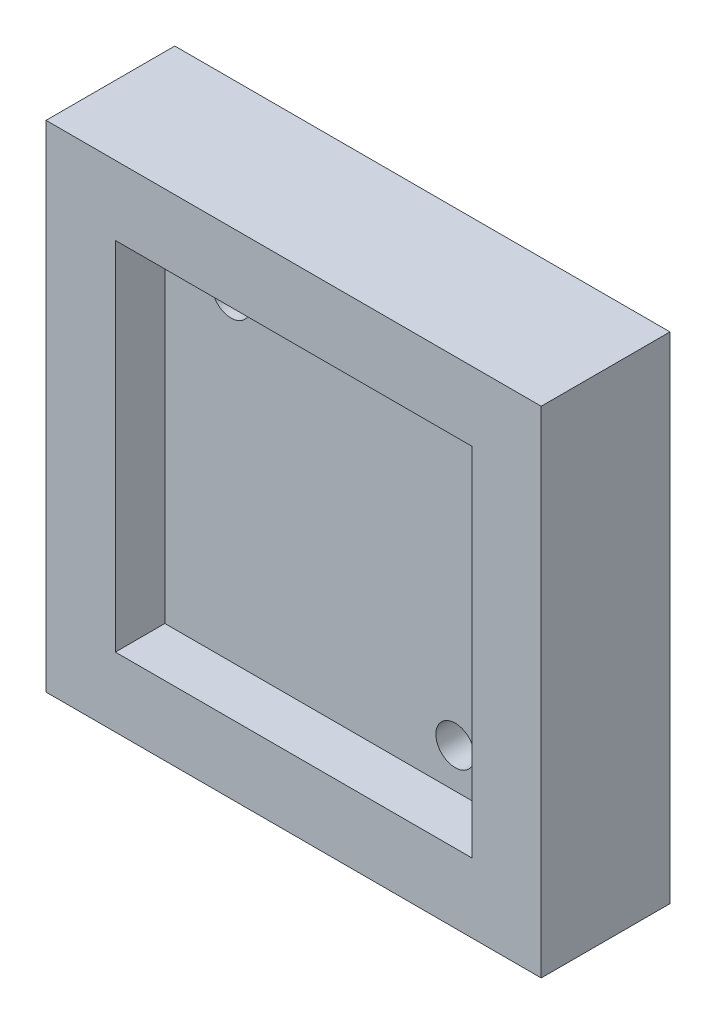
ISO-10303-21;
HEADER;
FILE_DESCRIPTION(('STEP AP214'),'2;1');
FILE_NAME('part.step','',(''),(''),'','','');
FILE_SCHEMA(('AUTOMOTIVE_DESIGN { 1 0 10303 214 1 1 1 1 }'));
ENDSEC;
DATA;
#1=APPLICATION_CONTEXT('core data for automotive mechanical design processes');
#2=APPLICATION_PROTOCOL_DEFINITION('international standard','automotive_design',2000,#1);
#3=PRODUCT_CONTEXT('',#1,'mechanical');
#4=PRODUCT('Part','Part','',(#3));
#5=PRODUCT_RELATED_PRODUCT_CATEGORY('part','',(#4));
#6=PRODUCT_DEFINITION_FORMATION('','',#4);
#7=PRODUCT_DEFINITION_CONTEXT('part definition',#1,'design');
#8=PRODUCT_DEFINITION('design','',#6,#7);
#9=PRODUCT_DEFINITION_SHAPE('','',#8);
#10=(LENGTH_UNIT() NAMED_UNIT(*) SI_UNIT(.MILLI.,.METRE.));
#11=(NAMED_UNIT(*) PLANE_ANGLE_UNIT() SI_UNIT($,.RADIAN.));
#12=(NAMED_UNIT(*) SI_UNIT($,.STERADIAN.) SOLID_ANGLE_UNIT());
#13=UNCERTAINTY_MEASURE_WITH_UNIT(LENGTH_MEASURE(1.E-05),#10,'distance_accuracy_value','');
#14=(GEOMETRIC_REPRESENTATION_CONTEXT(3) GLOBAL_UNCERTAINTY_ASSIGNED_CONTEXT((#13)) GLOBAL_UNIT_ASSIGNED_CONTEXT((#10,
#11,#12)) REPRESENTATION_CONTEXT('',''));
#15=CARTESIAN_POINT('',(0.,0.,0.));
#16=DIRECTION('',(0.,0.,1.));
#17=DIRECTION('',(1.,0.,0.));
#18=AXIS2_PLACEMENT_3D('',#15,#16,#17);
#19=CARTESIAN_POINT('',(25.,-25.,-6.5));
#20=DIRECTION('',(1.,0.,0.));
#21=DIRECTION('',(0.,0.,-1.));
#22=AXIS2_PLACEMENT_3D('',#19,#20,#21);
#23=PLANE('',#22);
#24=DIRECTION('',(0.,0.,1.));
#25=VECTOR('',#24,1.);
#26=CARTESIAN_POINT('',(25.,25.,-6.5));
#27=LINE('',#26,#25);
#28=CARTESIAN_POINT('',(25.,25.,-6.5));
#29=VERTEX_POINT('',#28);
#30=CARTESIAN_POINT('',(25.,25.,6.5));
#31=VERTEX_POINT('',#30);
#32=EDGE_CURVE('E216',#29,#31,#27,.T.);
#33=ORIENTED_EDGE('',*,*,#32,.T.);
#34=DIRECTION('',(0.,1.,0.));
#35=VECTOR('',#34,1.);
#36=CARTESIAN_POINT('',(25.,-25.,6.5));
#37=LINE('',#36,#35);
#38=CARTESIAN_POINT('',(25.,-25.,6.5));
#39=VERTEX_POINT('',#38);
#40=EDGE_CURVE('E188',#39,#31,#37,.T.);
#41=ORIENTED_EDGE('',*,*,#40,.F.);
#42=DIRECTION('',(0.,0.,1.));
#43=VECTOR('',#42,1.);
#44=CARTESIAN_POINT('',(25.,-25.,-6.5));
#45=LINE('',#44,#43);
#46=CARTESIAN_POINT('',(25.,-25.,-6.5));
#47=VERTEX_POINT('',#46);
#48=EDGE_CURVE('E11',#47,#39,#45,.T.);
#49=ORIENTED_EDGE('',*,*,#48,.F.);
#50=DIRECTION('',(0.,1.,0.));
#51=VECTOR('',#50,1.);
#52=CARTESIAN_POINT('',(25.,-25.,-6.5));
#53=LINE('',#52,#51);
#54=EDGE_CURVE('E205',#47,#29,#53,.T.);
#55=ORIENTED_EDGE('',*,*,#54,.T.);
#56=EDGE_LOOP('',(#33,#41,#49,#55));
#57=FACE_BOUND('',#56,.T.);
#58=ADVANCED_FACE('F32',(#57),#23,.T.);
#59=CARTESIAN_POINT('',(-25.,-25.,-6.5));
#60=DIRECTION('',(0.,-1.,0.));
#61=DIRECTION('',(0.,0.,-1.));
#62=AXIS2_PLACEMENT_3D('',#59,#60,#61);
#63=PLANE('',#62);
#64=ORIENTED_EDGE('',*,*,#48,.T.);
#65=DIRECTION('',(1.,0.,0.));
#66=VECTOR('',#65,1.);
#67=CARTESIAN_POINT('',(-25.,-25.,6.5));
#68=LINE('',#67,#66);
#69=CARTESIAN_POINT('',(-25.,-25.,6.5));
#70=VERTEX_POINT('',#69);
#71=EDGE_CURVE('E202',#70,#39,#68,.T.);
#72=ORIENTED_EDGE('',*,*,#71,.F.);
#73=DIRECTION('',(0.,0.,1.));
#74=VECTOR('',#73,1.);
#75=CARTESIAN_POINT('',(-25.,-25.,-6.5));
#76=LINE('',#75,#74);
#77=CARTESIAN_POINT('',(-25.,-25.,-6.5));
#78=VERTEX_POINT('',#77);
#79=EDGE_CURVE('E40',#78,#70,#76,.T.);
#80=ORIENTED_EDGE('',*,*,#79,.F.);
#81=DIRECTION('',(1.,0.,0.));
#82=VECTOR('',#81,1.);
#83=CARTESIAN_POINT('',(-25.,-25.,-6.5));
#84=LINE('',#83,#82);
#85=EDGE_CURVE('E214',#78,#47,#84,.T.);
#86=ORIENTED_EDGE('',*,*,#85,.T.);
#87=EDGE_LOOP('',(#64,#72,#80,#86));
#88=FACE_BOUND('',#87,.T.);
#89=ADVANCED_FACE('F277',(#88),#63,.T.);
#90=CARTESIAN_POINT('',(-25.,-25.,-6.5));
#91=DIRECTION('',(-1.,0.,0.));
#92=DIRECTION('',(0.,0.,1.));
#93=AXIS2_PLACEMENT_3D('',#90,#91,#92);
#94=PLANE('',#93);
#95=ORIENTED_EDGE('',*,*,#79,.T.);
#96=DIRECTION('',(0.,-1.,0.));
#97=VECTOR('',#96,1.);
#98=CARTESIAN_POINT('',(-25.,-25.,6.5));
#99=LINE('',#98,#97);
#100=CARTESIAN_POINT('',(-25.,25.,6.5));
#101=VERTEX_POINT('',#100);
#102=EDGE_CURVE('E199',#101,#70,#99,.T.);
#103=ORIENTED_EDGE('',*,*,#102,.F.);
#104=DIRECTION('',(0.,0.,1.));
#105=VECTOR('',#104,1.);
#106=CARTESIAN_POINT('',(-25.,25.,-6.5));
#107=LINE('',#106,#105);
#108=CARTESIAN_POINT('',(-25.,25.,-6.5));
#109=VERTEX_POINT('',#108);
#110=EDGE_CURVE('E219',#109,#101,#107,.T.);
#111=ORIENTED_EDGE('',*,*,#110,.F.);
#112=DIRECTION('',(0.,-1.,0.));
#113=VECTOR('',#112,1.);
#114=CARTESIAN_POINT('',(-25.,-25.,-6.5));
#115=LINE('',#114,#113);
#116=EDGE_CURVE('E211',#109,#78,#115,.T.);
#117=ORIENTED_EDGE('',*,*,#116,.T.);
#118=EDGE_LOOP('',(#95,#103,#111,#117));
#119=FACE_BOUND('',#118,.T.);
#120=ADVANCED_FACE('F273',(#119),#94,.T.);
#121=CARTESIAN_POINT('',(-25.,25.,-6.5));
#122=DIRECTION('',(0.,1.,0.));
#123=DIRECTION('',(0.,0.,1.));
#124=AXIS2_PLACEMENT_3D('',#121,#122,#123);
#125=PLANE('',#124);
#126=ORIENTED_EDGE('',*,*,#110,.T.);
#127=DIRECTION('',(-1.,0.,0.));
#128=VECTOR('',#127,1.);
#129=CARTESIAN_POINT('',(-25.,25.,6.5));
#130=LINE('',#129,#128);
#131=EDGE_CURVE('E196',#31,#101,#130,.T.);
#132=ORIENTED_EDGE('',*,*,#131,.F.);
#133=ORIENTED_EDGE('',*,*,#32,.F.);
#134=DIRECTION('',(-1.,0.,0.));
#135=VECTOR('',#134,1.);
#136=CARTESIAN_POINT('',(-25.,25.,-6.5));
#137=LINE('',#136,#135);
#138=EDGE_CURVE('E208',#29,#109,#137,.T.);
#139=ORIENTED_EDGE('',*,*,#138,.T.);
#140=EDGE_LOOP('',(#126,#132,#133,#139));
#141=FACE_BOUND('',#140,.T.);
#142=ADVANCED_FACE('F270',(#141),#125,.T.);
#143=CARTESIAN_POINT('',(0.,0.,-6.5));
#144=DIRECTION('',(0.,0.,-1.));
#145=DIRECTION('',(-1.,0.,0.));
#146=AXIS2_PLACEMENT_3D('',#143,#144,#145);
#147=PLANE('',#146);
#148=DIRECTION('',(0.,-1.,0.));
#149=VECTOR('',#148,1.);
#150=CARTESIAN_POINT('',(18.,18.,-6.5));
#151=LINE('',#150,#149);
#152=CARTESIAN_POINT('',(18.,18.,-6.5));
#153=VERTEX_POINT('',#152);
#154=CARTESIAN_POINT('',(18.,-18.,-6.5));
#155=VERTEX_POINT('',#154);
#156=EDGE_CURVE('E48',#153,#155,#151,.T.);
#157=ORIENTED_EDGE('',*,*,#156,.F.);
#158=DIRECTION('',(1.,0.,0.));
#159=VECTOR('',#158,1.);
#160=CARTESIAN_POINT('',(-18.,18.,-6.5));
#161=LINE('',#160,#159);
#162=CARTESIAN_POINT('',(-18.,18.,-6.5));
#163=VERTEX_POINT('',#162);
#164=EDGE_CURVE('E141',#163,#153,#161,.T.);
#165=ORIENTED_EDGE('',*,*,#164,.F.);
#166=DIRECTION('',(0.,1.,0.));
#167=VECTOR('',#166,1.);
#168=CARTESIAN_POINT('',(-18.,18.,-6.5));
#169=LINE('',#168,#167);
#170=CARTESIAN_POINT('',(-18.,-18.,-6.5));
#171=VERTEX_POINT('',#170);
#172=EDGE_CURVE('E144',#171,#163,#169,.T.);
#173=ORIENTED_EDGE('',*,*,#172,.F.);
#174=DIRECTION('',(-1.,0.,0.));
#175=VECTOR('',#174,1.);
#176=CARTESIAN_POINT('',(-18.,-18.,-6.5));
#177=LINE('',#176,#175);
#178=EDGE_CURVE('E153',#155,#171,#177,.T.);
#179=ORIENTED_EDGE('',*,*,#178,.F.);
#180=EDGE_LOOP('',(#157,#165,#173,#179));
#181=FACE_BOUND('',#180,.T.);
#182=ORIENTED_EDGE('',*,*,#54,.F.);
#183=ORIENTED_EDGE('',*,*,#85,.F.);
#184=ORIENTED_EDGE('',*,*,#116,.F.);
#185=ORIENTED_EDGE('',*,*,#138,.F.);
#186=EDGE_LOOP('',(#182,#183,#184,#185));
#187=FACE_BOUND('',#186,.T.);
#188=ADVANCED_FACE('F260',(#181,#187),#147,.T.);
#189=CARTESIAN_POINT('',(0.,0.,6.5));
#190=DIRECTION('',(0.,0.,-1.));
#191=DIRECTION('',(-1.,0.,0.));
#192=AXIS2_PLACEMENT_3D('',#189,#190,#191);
#193=PLANE('',#192);
#194=DIRECTION('',(1.,0.,0.));
#195=VECTOR('',#194,1.);
#196=CARTESIAN_POINT('',(18.,-18.,6.5));
#197=LINE('',#196,#195);
#198=CARTESIAN_POINT('',(-18.,-18.,6.5));
#199=VERTEX_POINT('',#198);
#200=CARTESIAN_POINT('',(18.,-18.,6.5));
#201=VERTEX_POINT('',#200);
#202=EDGE_CURVE('E178',#199,#201,#197,.T.);
#203=ORIENTED_EDGE('',*,*,#202,.F.);
#204=DIRECTION('',(0.,-1.,0.));
#205=VECTOR('',#204,1.);
#206=CARTESIAN_POINT('',(-18.,-18.,6.5));
#207=LINE('',#206,#205);
#208=CARTESIAN_POINT('',(-18.,18.,6.5));
#209=VERTEX_POINT('',#208);
#210=EDGE_CURVE('E56',#209,#199,#207,.T.);
#211=ORIENTED_EDGE('',*,*,#210,.F.);
#212=DIRECTION('',(-1.,0.,0.));
#213=VECTOR('',#212,1.);
#214=CARTESIAN_POINT('',(18.,18.,6.5));
#215=LINE('',#214,#213);
#216=CARTESIAN_POINT('',(18.,18.,6.5));
#217=VERTEX_POINT('',#216);
#218=EDGE_CURVE('E167',#217,#209,#215,.T.);
#219=ORIENTED_EDGE('',*,*,#218,.F.);
#220=DIRECTION('',(0.,1.,0.));
#221=VECTOR('',#220,1.);
#222=CARTESIAN_POINT('',(18.,-18.,6.5));
#223=LINE('',#222,#221);
#224=EDGE_CURVE('E181',#201,#217,#223,.T.);
#225=ORIENTED_EDGE('',*,*,#224,.F.);
#226=EDGE_LOOP('',(#203,#211,#219,#225));
#227=FACE_BOUND('',#226,.T.);
#228=ORIENTED_EDGE('',*,*,#40,.T.);
#229=ORIENTED_EDGE('',*,*,#131,.T.);
#230=ORIENTED_EDGE('',*,*,#102,.T.);
#231=ORIENTED_EDGE('',*,*,#71,.T.);
#232=EDGE_LOOP('',(#228,#229,#230,#231));
#233=FACE_BOUND('',#232,.T.);
#234=ADVANCED_FACE('F257',(#227,#233),#193,.F.);
#235=CARTESIAN_POINT('',(-18.,-18.,1.5));
#236=DIRECTION('',(-1.,0.,0.));
#237=DIRECTION('',(0.,0.,1.));
#238=AXIS2_PLACEMENT_3D('',#235,#236,#237);
#239=PLANE('',#238);
#240=ORIENTED_EDGE('',*,*,#210,.T.);
#241=DIRECTION('',(0.,0.,1.));
#242=VECTOR('',#241,1.);
#243=CARTESIAN_POINT('',(-18.,-18.,1.5));
#244=LINE('',#243,#242);
#245=CARTESIAN_POINT('',(-18.,-18.,1.5));
#246=VERTEX_POINT('',#245);
#247=EDGE_CURVE('E176',#246,#199,#244,.T.);
#248=ORIENTED_EDGE('',*,*,#247,.F.);
#249=DIRECTION('',(0.,-1.,0.));
#250=VECTOR('',#249,1.);
#251=CARTESIAN_POINT('',(-18.,-18.,1.5));
#252=LINE('',#251,#250);
#253=CARTESIAN_POINT('',(-18.,18.,1.5));
#254=VERTEX_POINT('',#253);
#255=EDGE_CURVE('E163',#254,#246,#252,.T.);
#256=ORIENTED_EDGE('',*,*,#255,.F.);
#257=DIRECTION('',(0.,0.,1.));
#258=VECTOR('',#257,1.);
#259=CARTESIAN_POINT('',(-18.,18.,1.5));
#260=LINE('',#259,#258);
#261=EDGE_CURVE('E186',#254,#209,#260,.T.);
#262=ORIENTED_EDGE('',*,*,#261,.T.);
#263=EDGE_LOOP('',(#240,#248,#256,#262));
#264=FACE_BOUND('',#263,.T.);
#265=ADVANCED_FACE('F246',(#264),#239,.F.);
#266=CARTESIAN_POINT('',(18.,18.,1.5));
#267=DIRECTION('',(0.,1.,0.));
#268=DIRECTION('',(0.,0.,1.));
#269=AXIS2_PLACEMENT_3D('',#266,#267,#268);
#270=PLANE('',#269);
#271=ORIENTED_EDGE('',*,*,#218,.T.);
#272=ORIENTED_EDGE('',*,*,#261,.F.);
#273=DIRECTION('',(-1.,0.,0.));
#274=VECTOR('',#273,1.);
#275=CARTESIAN_POINT('',(18.,18.,1.5));
#276=LINE('',#275,#274);
#277=CARTESIAN_POINT('',(18.,18.,1.5));
#278=VERTEX_POINT('',#277);
#279=EDGE_CURVE('E173',#278,#254,#276,.T.);
#280=ORIENTED_EDGE('',*,*,#279,.F.);
#281=DIRECTION('',(0.,0.,1.));
#282=VECTOR('',#281,1.);
#283=CARTESIAN_POINT('',(18.,18.,1.5));
#284=LINE('',#283,#282);
#285=EDGE_CURVE('E189',#278,#217,#284,.T.);
#286=ORIENTED_EDGE('',*,*,#285,.T.);
#287=EDGE_LOOP('',(#271,#272,#280,#286));
#288=FACE_BOUND('',#287,.T.);
#289=ADVANCED_FACE('F254',(#288),#270,.F.);
#290=CARTESIAN_POINT('',(18.,-18.,1.5));
#291=DIRECTION('',(1.,0.,0.));
#292=DIRECTION('',(0.,0.,-1.));
#293=AXIS2_PLACEMENT_3D('',#290,#291,#292);
#294=PLANE('',#293);
#295=ORIENTED_EDGE('',*,*,#224,.T.);
#296=ORIENTED_EDGE('',*,*,#285,.F.);
#297=DIRECTION('',(0.,1.,0.));
#298=VECTOR('',#297,1.);
#299=CARTESIAN_POINT('',(18.,-18.,1.5));
#300=LINE('',#299,#298);
#301=CARTESIAN_POINT('',(18.,-18.,1.5));
#302=VERTEX_POINT('',#301);
#303=EDGE_CURVE('E170',#302,#278,#300,.T.);
#304=ORIENTED_EDGE('',*,*,#303,.F.);
#305=DIRECTION('',(0.,0.,1.));
#306=VECTOR('',#305,1.);
#307=CARTESIAN_POINT('',(18.,-18.,1.5));
#308=LINE('',#307,#306);
#309=EDGE_CURVE('E191',#302,#201,#308,.T.);
#310=ORIENTED_EDGE('',*,*,#309,.T.);
#311=EDGE_LOOP('',(#295,#296,#304,#310));
#312=FACE_BOUND('',#311,.T.);
#313=ADVANCED_FACE('F252',(#312),#294,.F.);
#314=CARTESIAN_POINT('',(18.,-18.,1.5));
#315=DIRECTION('',(0.,-1.,0.));
#316=DIRECTION('',(0.,0.,-1.));
#317=AXIS2_PLACEMENT_3D('',#314,#315,#316);
#318=PLANE('',#317);
#319=ORIENTED_EDGE('',*,*,#202,.T.);
#320=ORIENTED_EDGE('',*,*,#309,.F.);
#321=DIRECTION('',(1.,0.,0.));
#322=VECTOR('',#321,1.);
#323=CARTESIAN_POINT('',(18.,-18.,1.5));
#324=LINE('',#323,#322);
#325=EDGE_CURVE('E166',#246,#302,#324,.T.);
#326=ORIENTED_EDGE('',*,*,#325,.F.);
#327=ORIENTED_EDGE('',*,*,#247,.T.);
#328=EDGE_LOOP('',(#319,#320,#326,#327));
#329=FACE_BOUND('',#328,.T.);
#330=ADVANCED_FACE('F240',(#329),#318,.F.);
#331=CARTESIAN_POINT('',(0.,0.,1.5));
#332=DIRECTION('',(0.,0.,1.));
#333=DIRECTION('',(1.,0.,0.));
#334=AXIS2_PLACEMENT_3D('',#331,#332,#333);
#335=PLANE('',#334);
#336=CARTESIAN_POINT('',(-11.3137084989848,14.,1.5));
#337=DIRECTION('',(0.,0.,1.));
#338=DIRECTION('',(1.,0.,0.));
#339=AXIS2_PLACEMENT_3D('',#336,#337,#338);
#340=CIRCLE('',#339,1.94999999999999);
#341=CARTESIAN_POINT('',(-9.36370849898477,14.,1.5));
#342=VERTEX_POINT('',#341);
#343=EDGE_CURVE('E228',#342,#342,#340,.T.);
#344=ORIENTED_EDGE('',*,*,#343,.F.);
#345=EDGE_LOOP('',(#344));
#346=FACE_BOUND('',#345,.T.);
#347=CARTESIAN_POINT('',(11.3137084989848,-14.,1.5));
#348=DIRECTION('',(0.,0.,1.));
#349=DIRECTION('',(1.,0.,0.));
#350=AXIS2_PLACEMENT_3D('',#347,#348,#349);
#351=CIRCLE('',#350,1.94999999999999);
#352=CARTESIAN_POINT('',(13.2637084989847,-14.,1.5));
#353=VERTEX_POINT('',#352);
#354=EDGE_CURVE('E147',#353,#353,#351,.T.);
#355=ORIENTED_EDGE('',*,*,#354,.F.);
#356=EDGE_LOOP('',(#355));
#357=FACE_BOUND('',#356,.T.);
#358=ORIENTED_EDGE('',*,*,#255,.T.);
#359=ORIENTED_EDGE('',*,*,#325,.T.);
#360=ORIENTED_EDGE('',*,*,#303,.T.);
#361=ORIENTED_EDGE('',*,*,#279,.T.);
#362=EDGE_LOOP('',(#358,#359,#360,#361));
#363=FACE_BOUND('',#362,.T.);
#364=ADVANCED_FACE('F237',(#346,#357,#363),#335,.T.);
#365=CARTESIAN_POINT('',(18.,18.,-1.5));
#366=DIRECTION('',(1.,0.,0.));
#367=DIRECTION('',(0.,0.,-1.));
#368=AXIS2_PLACEMENT_3D('',#365,#366,#367);
#369=PLANE('',#368);
#370=ORIENTED_EDGE('',*,*,#156,.T.);
#371=DIRECTION('',(0.,0.,-1.));
#372=VECTOR('',#371,1.);
#373=CARTESIAN_POINT('',(18.,-18.,-1.5));
#374=LINE('',#373,#372);
#375=CARTESIAN_POINT('',(18.,-18.,-1.5));
#376=VERTEX_POINT('',#375);
#377=EDGE_CURVE('E119',#376,#155,#374,.T.);
#378=ORIENTED_EDGE('',*,*,#377,.F.);
#379=DIRECTION('',(0.,-1.,0.));
#380=VECTOR('',#379,1.);
#381=CARTESIAN_POINT('',(18.,18.,-1.5));
#382=LINE('',#381,#380);
#383=CARTESIAN_POINT('',(18.,18.,-1.5));
#384=VERTEX_POINT('',#383);
#385=EDGE_CURVE('E123',#384,#376,#382,.T.);
#386=ORIENTED_EDGE('',*,*,#385,.F.);
#387=DIRECTION('',(0.,0.,-1.));
#388=VECTOR('',#387,1.);
#389=CARTESIAN_POINT('',(18.,18.,-1.5));
#390=LINE('',#389,#388);
#391=EDGE_CURVE('E158',#384,#153,#390,.T.);
#392=ORIENTED_EDGE('',*,*,#391,.T.);
#393=EDGE_LOOP('',(#370,#378,#386,#392));
#394=FACE_BOUND('',#393,.T.);
#395=ADVANCED_FACE('F121',(#394),#369,.F.);
#396=CARTESIAN_POINT('',(-18.,18.,-1.5));
#397=DIRECTION('',(0.,1.,0.));
#398=DIRECTION('',(0.,0.,1.));
#399=AXIS2_PLACEMENT_3D('',#396,#397,#398);
#400=PLANE('',#399);
#401=ORIENTED_EDGE('',*,*,#164,.T.);
#402=ORIENTED_EDGE('',*,*,#391,.F.);
#403=DIRECTION('',(1.,0.,0.));
#404=VECTOR('',#403,1.);
#405=CARTESIAN_POINT('',(-18.,18.,-1.5));
#406=LINE('',#405,#404);
#407=CARTESIAN_POINT('',(-18.,18.,-1.5));
#408=VERTEX_POINT('',#407);
#409=EDGE_CURVE('E129',#408,#384,#406,.T.);
#410=ORIENTED_EDGE('',*,*,#409,.F.);
#411=DIRECTION('',(0.,0.,-1.));
#412=VECTOR('',#411,1.);
#413=CARTESIAN_POINT('',(-18.,18.,-1.5));
#414=LINE('',#413,#412);
#415=EDGE_CURVE('E160',#408,#163,#414,.T.);
#416=ORIENTED_EDGE('',*,*,#415,.T.);
#417=EDGE_LOOP('',(#401,#402,#410,#416));
#418=FACE_BOUND('',#417,.T.);
#419=ADVANCED_FACE('F298',(#418),#400,.F.);
#420=CARTESIAN_POINT('',(-18.,18.,-1.5));
#421=DIRECTION('',(-1.,0.,0.));
#422=DIRECTION('',(0.,0.,1.));
#423=AXIS2_PLACEMENT_3D('',#420,#421,#422);
#424=PLANE('',#423);
#425=ORIENTED_EDGE('',*,*,#172,.T.);
#426=ORIENTED_EDGE('',*,*,#415,.F.);
#427=DIRECTION('',(0.,1.,0.));
#428=VECTOR('',#427,1.);
#429=CARTESIAN_POINT('',(-18.,18.,-1.5));
#430=LINE('',#429,#428);
#431=CARTESIAN_POINT('',(-18.,-18.,-1.5));
#432=VERTEX_POINT('',#431);
#433=EDGE_CURVE('E137',#432,#408,#430,.T.);
#434=ORIENTED_EDGE('',*,*,#433,.F.);
#435=DIRECTION('',(0.,0.,-1.));
#436=VECTOR('',#435,1.);
#437=CARTESIAN_POINT('',(-18.,-18.,-1.5));
#438=LINE('',#437,#436);
#439=EDGE_CURVE('E128',#432,#171,#438,.T.);
#440=ORIENTED_EDGE('',*,*,#439,.T.);
#441=EDGE_LOOP('',(#425,#426,#434,#440));
#442=FACE_BOUND('',#441,.T.);
#443=ADVANCED_FACE('F296',(#442),#424,.F.);
#444=CARTESIAN_POINT('',(-18.,-18.,-1.5));
#445=DIRECTION('',(0.,-1.,0.));
#446=DIRECTION('',(0.,0.,-1.));
#447=AXIS2_PLACEMENT_3D('',#444,#445,#446);
#448=PLANE('',#447);
#449=ORIENTED_EDGE('',*,*,#178,.T.);
#450=ORIENTED_EDGE('',*,*,#439,.F.);
#451=DIRECTION('',(-1.,0.,0.));
#452=VECTOR('',#451,1.);
#453=CARTESIAN_POINT('',(-18.,-18.,-1.5));
#454=LINE('',#453,#452);
#455=EDGE_CURVE('E132',#376,#432,#454,.T.);
#456=ORIENTED_EDGE('',*,*,#455,.F.);
#457=ORIENTED_EDGE('',*,*,#377,.T.);
#458=EDGE_LOOP('',(#449,#450,#456,#457));
#459=FACE_BOUND('',#458,.T.);
#460=ADVANCED_FACE('F133',(#459),#448,.F.);
#461=CARTESIAN_POINT('',(0.,0.,-1.5));
#462=DIRECTION('',(0.,0.,1.));
#463=DIRECTION('',(1.,0.,0.));
#464=AXIS2_PLACEMENT_3D('',#461,#462,#463);
#465=PLANE('',#464);
#466=CARTESIAN_POINT('',(-11.3137084989848,14.,-1.5));
#467=DIRECTION('',(0.,0.,1.));
#468=DIRECTION('',(1.,0.,0.));
#469=AXIS2_PLACEMENT_3D('',#466,#467,#468);
#470=CIRCLE('',#469,1.94999999999999);
#471=CARTESIAN_POINT('',(-9.36370849898477,14.,-1.5));
#472=VERTEX_POINT('',#471);
#473=EDGE_CURVE('E35',#472,#472,#470,.T.);
#474=ORIENTED_EDGE('',*,*,#473,.T.);
#475=EDGE_LOOP('',(#474));
#476=FACE_BOUND('',#475,.T.);
#477=CARTESIAN_POINT('',(11.3137084989848,-14.,-1.5));
#478=DIRECTION('',(0.,0.,1.));
#479=DIRECTION('',(1.,0.,0.));
#480=AXIS2_PLACEMENT_3D('',#477,#478,#479);
#481=CIRCLE('',#480,1.94999999999999);
#482=CARTESIAN_POINT('',(13.2637084989848,-14.,-1.5));
#483=VERTEX_POINT('',#482);
#484=EDGE_CURVE('E154',#483,#483,#481,.T.);
#485=ORIENTED_EDGE('',*,*,#484,.T.);
#486=EDGE_LOOP('',(#485));
#487=FACE_BOUND('',#486,.T.);
#488=ORIENTED_EDGE('',*,*,#385,.T.);
#489=ORIENTED_EDGE('',*,*,#455,.T.);
#490=ORIENTED_EDGE('',*,*,#433,.T.);
#491=ORIENTED_EDGE('',*,*,#409,.T.);
#492=EDGE_LOOP('',(#488,#489,#490,#491));
#493=FACE_BOUND('',#492,.T.);
#494=ADVANCED_FACE('F139',(#476,#487,#493),#465,.F.);
#495=CARTESIAN_POINT('',(11.3137084989848,-14.,1.5));
#496=DIRECTION('',(0.,0.,1.));
#497=DIRECTION('',(1.,0.,0.));
#498=AXIS2_PLACEMENT_3D('',#495,#496,#497);
#499=CYLINDRICAL_SURFACE('',#498,1.94999999999999);
#500=ORIENTED_EDGE('',*,*,#354,.T.);
#501=EDGE_LOOP('',(#500));
#502=FACE_BOUND('',#501,.T.);
#503=ORIENTED_EDGE('',*,*,#484,.F.);
#504=EDGE_LOOP('',(#503));
#505=FACE_BOUND('',#504,.T.);
#506=ADVANCED_FACE('F370',(#502,#505),#499,.F.);
#507=CARTESIAN_POINT('',(-11.3137084989848,14.,1.5));
#508=DIRECTION('',(0.,0.,1.));
#509=DIRECTION('',(1.,0.,0.));
#510=AXIS2_PLACEMENT_3D('',#507,#508,#509);
#511=CYLINDRICAL_SURFACE('',#510,1.94999999999999);
#512=ORIENTED_EDGE('',*,*,#343,.T.);
#513=EDGE_LOOP('',(#512));
#514=FACE_BOUND('',#513,.T.);
#515=ORIENTED_EDGE('',*,*,#473,.F.);
#516=EDGE_LOOP('',(#515));
#517=FACE_BOUND('',#516,.T.);
#518=ADVANCED_FACE('F234',(#514,#517),#511,.F.);
#519=CLOSED_SHELL('',(#58,#89,#120,#142,#188,#234,#265,#289,#313,#330,#364,#395,#419,#443,#460,
#494,#506,#518));
#520=MANIFOLD_SOLID_BREP('B2',#519);
#521=ADVANCED_BREP_SHAPE_REPRESENTATION('',(#18,#520),#14);
#522=SHAPE_DEFINITION_REPRESENTATION(#9,#521);
ENDSEC;
END-ISO-10303-21;
